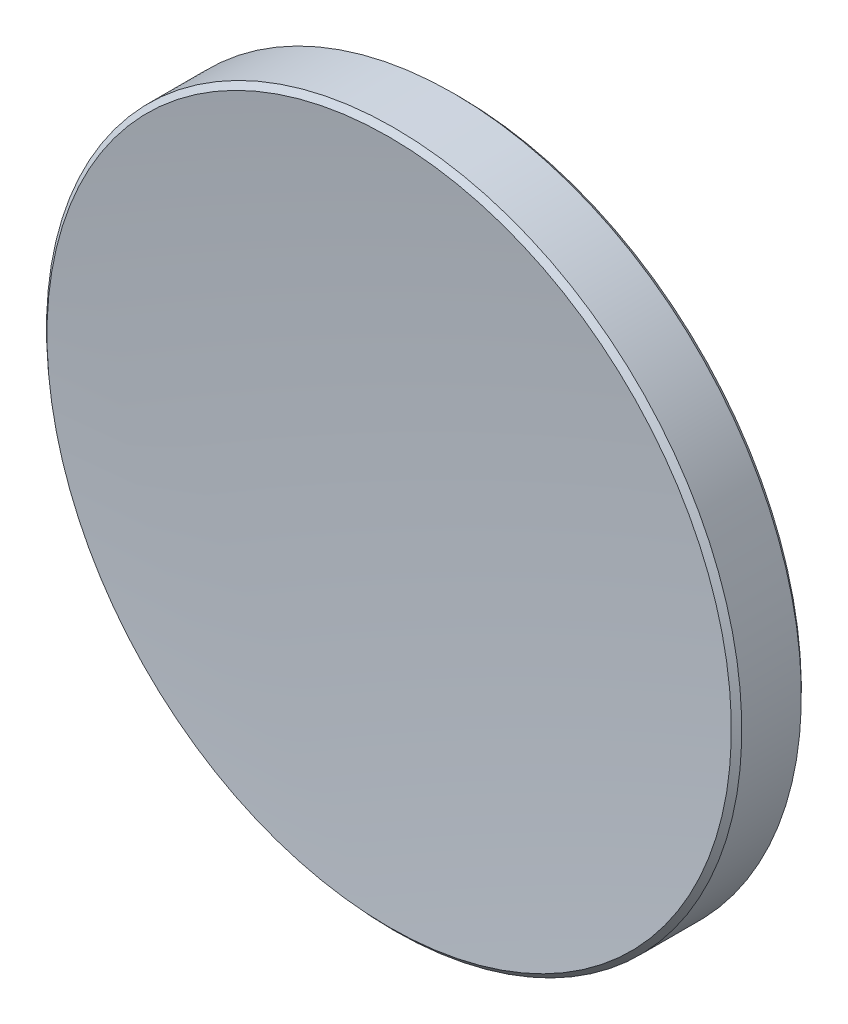
ISO-10303-21;
HEADER;
FILE_DESCRIPTION(('STEP AP214'),'2;1');
FILE_NAME('part.step','',(''),(''),'','','');
FILE_SCHEMA(('AUTOMOTIVE_DESIGN { 1 0 10303 214 1 1 1 1 }'));
ENDSEC;
DATA;
#1=APPLICATION_CONTEXT('core data for automotive mechanical design processes');
#2=APPLICATION_PROTOCOL_DEFINITION('international standard','automotive_design',2000,#1);
#3=PRODUCT_CONTEXT('',#1,'mechanical');
#4=PRODUCT('Part','Part','',(#3));
#5=PRODUCT_RELATED_PRODUCT_CATEGORY('part','',(#4));
#6=PRODUCT_DEFINITION_FORMATION('','',#4);
#7=PRODUCT_DEFINITION_CONTEXT('part definition',#1,'design');
#8=PRODUCT_DEFINITION('design','',#6,#7);
#9=PRODUCT_DEFINITION_SHAPE('','',#8);
#10=(LENGTH_UNIT() NAMED_UNIT(*) SI_UNIT(.MILLI.,.METRE.));
#11=(NAMED_UNIT(*) PLANE_ANGLE_UNIT() SI_UNIT($,.RADIAN.));
#12=(NAMED_UNIT(*) SI_UNIT($,.STERADIAN.) SOLID_ANGLE_UNIT());
#13=UNCERTAINTY_MEASURE_WITH_UNIT(LENGTH_MEASURE(1.E-05),#10,'distance_accuracy_value','');
#14=(GEOMETRIC_REPRESENTATION_CONTEXT(3) GLOBAL_UNCERTAINTY_ASSIGNED_CONTEXT((#13)) GLOBAL_UNIT_ASSIGNED_CONTEXT((#10,
#11,#12)) REPRESENTATION_CONTEXT('',''));
#15=CARTESIAN_POINT('',(0.,0.,0.));
#16=DIRECTION('',(0.,0.,1.));
#17=DIRECTION('',(1.,0.,0.));
#18=AXIS2_PLACEMENT_3D('',#15,#16,#17);
#19=CARTESIAN_POINT('',(0.,0.,-1.));
#20=DIRECTION('',(0.,0.,-1.));
#21=DIRECTION('',(0.,1.,0.));
#22=AXIS2_PLACEMENT_3D('',#19,#20,#21);
#23=PLANE('',#22);
#24=CARTESIAN_POINT('',(0.,0.,-1.));
#25=DIRECTION('',(0.,0.,-1.));
#26=DIRECTION('',(0.,1.,0.));
#27=AXIS2_PLACEMENT_3D('',#24,#25,#26);
#28=CIRCLE('',#27,12.5);
#29=CARTESIAN_POINT('',(0.,12.5,-0.999999999999998));
#30=VERTEX_POINT('',#29);
#31=EDGE_CURVE('E28',#30,#30,#28,.T.);
#32=ORIENTED_EDGE('',*,*,#31,.T.);
#33=EDGE_LOOP('',(#32));
#34=FACE_BOUND('',#33,.T.);
#35=ADVANCED_FACE('F13',(#34),#23,.T.);
#36=CARTESIAN_POINT('',(0.,0.,-1.));
#37=DIRECTION('',(0.,0.,-1.));
#38=DIRECTION('',(0.,1.,0.));
#39=AXIS2_PLACEMENT_3D('',#36,#37,#38);
#40=CYLINDRICAL_SURFACE('',#39,12.7);
#41=CARTESIAN_POINT('',(0.,0.,-0.800000000000013));
#42=DIRECTION('',(0.,0.,-1.));
#43=DIRECTION('',(0.,1.,0.));
#44=AXIS2_PLACEMENT_3D('',#41,#42,#43);
#45=CIRCLE('',#44,12.7);
#46=CARTESIAN_POINT('',(0.,12.7,-0.80000000000001));
#47=VERTEX_POINT('',#46);
#48=EDGE_CURVE('E20',#47,#47,#45,.F.);
#49=ORIENTED_EDGE('',*,*,#48,.T.);
#50=EDGE_LOOP('',(#49));
#51=FACE_BOUND('',#50,.T.);
#52=CARTESIAN_POINT('',(0.,0.,1.37612650875513));
#53=DIRECTION('',(0.,0.,1.));
#54=DIRECTION('',(0.,-1.,0.));
#55=AXIS2_PLACEMENT_3D('',#52,#53,#54);
#56=CIRCLE('',#55,12.7);
#57=CARTESIAN_POINT('',(0.,-12.7,1.37612650875512));
#58=VERTEX_POINT('',#57);
#59=EDGE_CURVE('E24',#58,#58,#56,.F.);
#60=ORIENTED_EDGE('',*,*,#59,.T.);
#61=EDGE_LOOP('',(#60));
#62=FACE_BOUND('',#61,.T.);
#63=ADVANCED_FACE('F45',(#51,#62),#40,.T.);
#64=CARTESIAN_POINT('',(0.,0.,141.266));
#65=DIRECTION('',(0.,0.,-1.));
#66=DIRECTION('',(0.,1.,0.));
#67=AXIS2_PLACEMENT_3D('',#64,#65,#66);
#68=SPHERICAL_SURFACE('',#67,140.266);
#69=CARTESIAN_POINT('',(0.,0.,1.55814843853813));
#70=DIRECTION('',(0.,0.,1.));
#71=DIRECTION('',(0.,-1.,0.));
#72=AXIS2_PLACEMENT_3D('',#69,#70,#71);
#73=CIRCLE('',#72,12.5006787047958);
#74=CARTESIAN_POINT('',(0.,-12.5006787047958,1.55814843853813));
#75=VERTEX_POINT('',#74);
#76=EDGE_CURVE('E9',#75,#75,#73,.T.);
#77=ORIENTED_EDGE('',*,*,#76,.T.);
#78=EDGE_LOOP('',(#77));
#79=FACE_BOUND('',#78,.T.);
#80=ADVANCED_FACE('F37',(#79),#68,.F.);
#81=CARTESIAN_POINT('',(0.,0.,-1.));
#82=DIRECTION('',(0.,0.,1.));
#83=DIRECTION('',(0.,-1.,0.));
#84=AXIS2_PLACEMENT_3D('',#81,#82,#83);
#85=CONICAL_SURFACE('',#84,12.5,0.785398163397465);
#86=ORIENTED_EDGE('',*,*,#48,.F.);
#87=EDGE_LOOP('',(#86));
#88=FACE_BOUND('',#87,.T.);
#89=ORIENTED_EDGE('',*,*,#31,.F.);
#90=EDGE_LOOP('',(#89));
#91=FACE_BOUND('',#90,.T.);
#92=ADVANCED_FACE('F35',(#88,#91),#85,.T.);
#93=CARTESIAN_POINT('',(0.,0.,1.37612650875513));
#94=DIRECTION('',(0.,0.,-1.));
#95=DIRECTION('',(0.,1.,0.));
#96=AXIS2_PLACEMENT_3D('',#93,#94,#95);
#97=CONICAL_SURFACE('',#96,12.7,0.830731375113449);
#98=ORIENTED_EDGE('',*,*,#76,.F.);
#99=EDGE_LOOP('',(#98));
#100=FACE_BOUND('',#99,.T.);
#101=ORIENTED_EDGE('',*,*,#59,.F.);
#102=EDGE_LOOP('',(#101));
#103=FACE_BOUND('',#102,.T.);
#104=ADVANCED_FACE('F15',(#100,#103),#97,.T.);
#105=CLOSED_SHELL('',(#35,#63,#80,#92,#104));
#106=MANIFOLD_SOLID_BREP('B1',#105);
#107=ADVANCED_BREP_SHAPE_REPRESENTATION('',(#18,#106),#14);
#108=SHAPE_DEFINITION_REPRESENTATION(#9,#107);
ENDSEC;
END-ISO-10303-21;
